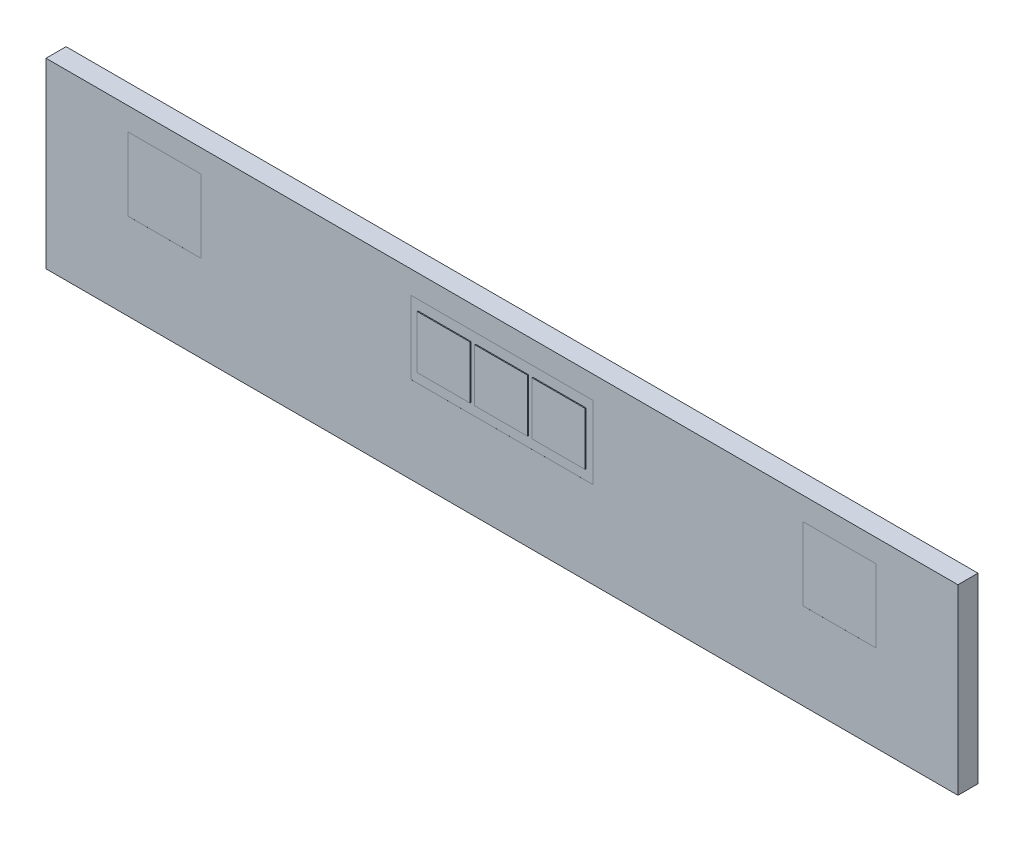
ISO-10303-21;
HEADER;
FILE_DESCRIPTION(('STEP AP214'),'2;1');
FILE_NAME('part.step','',(''),(''),'','','');
FILE_SCHEMA(('AUTOMOTIVE_DESIGN { 1 0 10303 214 1 1 1 1 }'));
ENDSEC;
DATA;
#1=APPLICATION_CONTEXT('core data for automotive mechanical design processes');
#2=APPLICATION_PROTOCOL_DEFINITION('international standard','automotive_design',2000,#1);
#3=PRODUCT_CONTEXT('',#1,'mechanical');
#4=PRODUCT('Part','Part','',(#3));
#5=PRODUCT_RELATED_PRODUCT_CATEGORY('part','',(#4));
#6=PRODUCT_DEFINITION_FORMATION('','',#4);
#7=PRODUCT_DEFINITION_CONTEXT('part definition',#1,'design');
#8=PRODUCT_DEFINITION('design','',#6,#7);
#9=PRODUCT_DEFINITION_SHAPE('','',#8);
#10=(LENGTH_UNIT() NAMED_UNIT(*) SI_UNIT(.MILLI.,.METRE.));
#11=(NAMED_UNIT(*) PLANE_ANGLE_UNIT() SI_UNIT($,.RADIAN.));
#12=(NAMED_UNIT(*) SI_UNIT($,.STERADIAN.) SOLID_ANGLE_UNIT());
#13=UNCERTAINTY_MEASURE_WITH_UNIT(LENGTH_MEASURE(1.E-05),#10,'distance_accuracy_value','');
#14=(GEOMETRIC_REPRESENTATION_CONTEXT(3) GLOBAL_UNCERTAINTY_ASSIGNED_CONTEXT((#13)) GLOBAL_UNIT_ASSIGNED_CONTEXT((#10,
#11,#12)) REPRESENTATION_CONTEXT('',''));
#15=CARTESIAN_POINT('',(0.,0.,0.));
#16=DIRECTION('',(0.,0.,1.));
#17=DIRECTION('',(1.,0.,0.));
#18=AXIS2_PLACEMENT_3D('',#15,#16,#17);
#19=CARTESIAN_POINT('',(-100.01,94.99,21.99));
#20=DIRECTION('',(0.,0.,1.));
#21=DIRECTION('',(1.,0.,0.));
#22=AXIS2_PLACEMENT_3D('',#19,#20,#21);
#23=PLANE('',#22);
#24=DIRECTION('',(1.,0.,0.));
#25=VECTOR('',#24,1.);
#26=CARTESIAN_POINT('',(0.,175.,21.99));
#27=LINE('',#26,#25);
#28=CARTESIAN_POINT('',(-100.,175.,21.99));
#29=VERTEX_POINT('',#28);
#30=CARTESIAN_POINT('',(100.,175.,21.99));
#31=VERTEX_POINT('',#30);
#32=EDGE_CURVE('E399',#29,#31,#27,.T.);
#33=ORIENTED_EDGE('',*,*,#32,.F.);
#34=DIRECTION('',(0.,1.,0.));
#35=VECTOR('',#34,1.);
#36=CARTESIAN_POINT('',(-100.,135.,21.99));
#37=LINE('',#36,#35);
#38=CARTESIAN_POINT('',(-100.,95.,21.99));
#39=VERTEX_POINT('',#38);
#40=EDGE_CURVE('E405',#39,#29,#37,.T.);
#41=ORIENTED_EDGE('',*,*,#40,.F.);
#42=DIRECTION('',(-1.,0.,0.));
#43=VECTOR('',#42,1.);
#44=CARTESIAN_POINT('',(0.,95.,21.99));
#45=LINE('',#44,#43);
#46=CARTESIAN_POINT('',(100.,95.,21.99));
#47=VERTEX_POINT('',#46);
#48=EDGE_CURVE('E410',#47,#39,#45,.T.);
#49=ORIENTED_EDGE('',*,*,#48,.F.);
#50=DIRECTION('',(0.,-1.,0.));
#51=VECTOR('',#50,1.);
#52=CARTESIAN_POINT('',(100.,135.,21.99));
#53=LINE('',#52,#51);
#54=EDGE_CURVE('E415',#31,#47,#53,.T.);
#55=ORIENTED_EDGE('',*,*,#54,.F.);
#56=EDGE_LOOP('',(#33,#41,#49,#55));
#57=FACE_BOUND('',#56,.T.);
#58=DIRECTION('',(1.,0.,0.));
#59=VECTOR('',#58,1.);
#60=CARTESIAN_POINT('',(-92.,106.,21.99));
#61=LINE('',#60,#59);
#62=CARTESIAN_POINT('',(-92.,106.,21.99));
#63=VERTEX_POINT('',#62);
#64=CARTESIAN_POINT('',(-34.,106.,21.99));
#65=VERTEX_POINT('',#64);
#66=EDGE_CURVE('E293',#63,#65,#61,.T.);
#67=ORIENTED_EDGE('',*,*,#66,.F.);
#68=DIRECTION('',(0.,-1.,0.));
#69=VECTOR('',#68,1.);
#70=CARTESIAN_POINT('',(-92.,164.,21.99));
#71=LINE('',#70,#69);
#72=CARTESIAN_POINT('',(-92.,164.,21.99));
#73=VERTEX_POINT('',#72);
#74=EDGE_CURVE('E279',#73,#63,#71,.T.);
#75=ORIENTED_EDGE('',*,*,#74,.F.);
#76=DIRECTION('',(-1.,0.,0.));
#77=VECTOR('',#76,1.);
#78=CARTESIAN_POINT('',(-92.,164.,21.99));
#79=LINE('',#78,#77);
#80=CARTESIAN_POINT('',(-34.,164.,21.99));
#81=VERTEX_POINT('',#80);
#82=EDGE_CURVE('E284',#81,#73,#79,.T.);
#83=ORIENTED_EDGE('',*,*,#82,.F.);
#84=DIRECTION('',(0.,1.,0.));
#85=VECTOR('',#84,1.);
#86=CARTESIAN_POINT('',(-34.,164.,21.99));
#87=LINE('',#86,#85);
#88=EDGE_CURVE('E295',#65,#81,#87,.T.);
#89=ORIENTED_EDGE('',*,*,#88,.F.);
#90=EDGE_LOOP('',(#67,#75,#83,#89));
#91=FACE_BOUND('',#90,.T.);
#92=DIRECTION('',(0.,-1.,0.));
#93=VECTOR('',#92,1.);
#94=CARTESIAN_POINT('',(34.,164.,21.99));
#95=LINE('',#94,#93);
#96=CARTESIAN_POINT('',(34.,164.,21.99));
#97=VERTEX_POINT('',#96);
#98=CARTESIAN_POINT('',(34.,106.,21.99));
#99=VERTEX_POINT('',#98);
#100=EDGE_CURVE('E251',#97,#99,#95,.T.);
#101=ORIENTED_EDGE('',*,*,#100,.F.);
#102=DIRECTION('',(-1.,0.,0.));
#103=VECTOR('',#102,1.);
#104=CARTESIAN_POINT('',(92.,164.,21.99));
#105=LINE('',#104,#103);
#106=CARTESIAN_POINT('',(92.,164.,21.99));
#107=VERTEX_POINT('',#106);
#108=EDGE_CURVE('E248',#107,#97,#105,.T.);
#109=ORIENTED_EDGE('',*,*,#108,.F.);
#110=DIRECTION('',(0.,1.,0.));
#111=VECTOR('',#110,1.);
#112=CARTESIAN_POINT('',(92.,164.,21.99));
#113=LINE('',#112,#111);
#114=CARTESIAN_POINT('',(92.,106.,21.99));
#115=VERTEX_POINT('',#114);
#116=EDGE_CURVE('E260',#115,#107,#113,.T.);
#117=ORIENTED_EDGE('',*,*,#116,.F.);
#118=DIRECTION('',(1.,0.,0.));
#119=VECTOR('',#118,1.);
#120=CARTESIAN_POINT('',(92.,106.,21.99));
#121=LINE('',#120,#119);
#122=EDGE_CURVE('E268',#99,#115,#121,.T.);
#123=ORIENTED_EDGE('',*,*,#122,.F.);
#124=EDGE_LOOP('',(#101,#109,#117,#123));
#125=FACE_BOUND('',#124,.T.);
#126=DIRECTION('',(1.,0.,0.));
#127=VECTOR('',#126,1.);
#128=CARTESIAN_POINT('',(-29.,106.,21.99));
#129=LINE('',#128,#127);
#130=CARTESIAN_POINT('',(-29.,106.,21.99));
#131=VERTEX_POINT('',#130);
#132=CARTESIAN_POINT('',(29.,106.,21.99));
#133=VERTEX_POINT('',#132);
#134=EDGE_CURVE('E694',#131,#133,#129,.T.);
#135=ORIENTED_EDGE('',*,*,#134,.F.);
#136=DIRECTION('',(0.,-1.,0.));
#137=VECTOR('',#136,1.);
#138=CARTESIAN_POINT('',(-29.,164.,21.99));
#139=LINE('',#138,#137);
#140=CARTESIAN_POINT('',(-29.,164.,21.99));
#141=VERTEX_POINT('',#140);
#142=EDGE_CURVE('E246',#141,#131,#139,.T.);
#143=ORIENTED_EDGE('',*,*,#142,.F.);
#144=DIRECTION('',(-1.,0.,0.));
#145=VECTOR('',#144,1.);
#146=CARTESIAN_POINT('',(29.,164.,21.99));
#147=LINE('',#146,#145);
#148=CARTESIAN_POINT('',(29.,164.,21.99));
#149=VERTEX_POINT('',#148);
#150=EDGE_CURVE('E242',#149,#141,#147,.T.);
#151=ORIENTED_EDGE('',*,*,#150,.F.);
#152=DIRECTION('',(0.,1.,0.));
#153=VECTOR('',#152,1.);
#154=CARTESIAN_POINT('',(29.,164.,21.99));
#155=LINE('',#154,#153);
#156=EDGE_CURVE('E691',#133,#149,#155,.T.);
#157=ORIENTED_EDGE('',*,*,#156,.F.);
#158=EDGE_LOOP('',(#135,#143,#151,#157));
#159=FACE_BOUND('',#158,.T.);
#160=ADVANCED_FACE('F35',(#57,#91,#125,#159),#23,.T.);
#161=CARTESIAN_POINT('',(329.99,94.99,21.99));
#162=DIRECTION('',(0.,0.,1.));
#163=DIRECTION('',(1.,0.,0.));
#164=AXIS2_PLACEMENT_3D('',#161,#162,#163);
#165=PLANE('',#164);
#166=DIRECTION('',(1.,0.,0.));
#167=VECTOR('',#166,1.);
#168=CARTESIAN_POINT('',(370.,175.,21.99));
#169=LINE('',#168,#167);
#170=CARTESIAN_POINT('',(330.,175.,21.99));
#171=VERTEX_POINT('',#170);
#172=CARTESIAN_POINT('',(410.,175.,21.99));
#173=VERTEX_POINT('',#172);
#174=EDGE_CURVE('E420',#171,#173,#169,.T.);
#175=ORIENTED_EDGE('',*,*,#174,.F.);
#176=DIRECTION('',(0.,1.,0.));
#177=VECTOR('',#176,1.);
#178=CARTESIAN_POINT('',(330.,135.,21.99));
#179=LINE('',#178,#177);
#180=CARTESIAN_POINT('',(330.,95.0000000000001,21.99));
#181=VERTEX_POINT('',#180);
#182=EDGE_CURVE('E426',#181,#171,#179,.T.);
#183=ORIENTED_EDGE('',*,*,#182,.F.);
#184=DIRECTION('',(-1.,0.,0.));
#185=VECTOR('',#184,1.);
#186=CARTESIAN_POINT('',(370.,95.0000000000001,21.99));
#187=LINE('',#186,#185);
#188=CARTESIAN_POINT('',(410.,95.,21.99));
#189=VERTEX_POINT('',#188);
#190=EDGE_CURVE('E431',#189,#181,#187,.T.);
#191=ORIENTED_EDGE('',*,*,#190,.F.);
#192=DIRECTION('',(0.,-1.,0.));
#193=VECTOR('',#192,1.);
#194=CARTESIAN_POINT('',(410.,135.,21.99));
#195=LINE('',#194,#193);
#196=EDGE_CURVE('E39',#173,#189,#195,.T.);
#197=ORIENTED_EDGE('',*,*,#196,.F.);
#198=EDGE_LOOP('',(#175,#183,#191,#197));
#199=FACE_BOUND('',#198,.T.);
#200=ADVANCED_FACE('F443',(#199),#165,.T.);
#201=CARTESIAN_POINT('',(410.,94.99,22.001));
#202=DIRECTION('',(-1.,0.,0.));
#203=DIRECTION('',(0.,1.,0.));
#204=AXIS2_PLACEMENT_3D('',#201,#202,#203);
#205=PLANE('',#204);
#206=ORIENTED_EDGE('',*,*,#196,.T.);
#207=DIRECTION('',(0.,0.,-1.));
#208=VECTOR('',#207,1.);
#209=CARTESIAN_POINT('',(410.,95.,21.995));
#210=LINE('',#209,#208);
#211=CARTESIAN_POINT('',(410.,95.,22.));
#212=VERTEX_POINT('',#211);
#213=EDGE_CURVE('E432',#212,#189,#210,.T.);
#214=ORIENTED_EDGE('',*,*,#213,.F.);
#215=DIRECTION('',(0.,-1.,0.));
#216=VECTOR('',#215,1.);
#217=CARTESIAN_POINT('',(410.,100.,22.));
#218=LINE('',#217,#216);
#219=CARTESIAN_POINT('',(410.,175.,22.));
#220=VERTEX_POINT('',#219);
#221=EDGE_CURVE('E387',#220,#212,#218,.T.);
#222=ORIENTED_EDGE('',*,*,#221,.F.);
#223=DIRECTION('',(0.,0.,1.));
#224=VECTOR('',#223,1.);
#225=CARTESIAN_POINT('',(410.,175.,21.995));
#226=LINE('',#225,#224);
#227=EDGE_CURVE('E417',#173,#220,#226,.T.);
#228=ORIENTED_EDGE('',*,*,#227,.F.);
#229=EDGE_LOOP('',(#206,#214,#222,#228));
#230=FACE_BOUND('',#229,.T.);
#231=ADVANCED_FACE('F439',(#230),#205,.T.);
#232=CARTESIAN_POINT('',(329.99,95.0000000000001,22.001));
#233=DIRECTION('',(0.,1.,0.));
#234=DIRECTION('',(1.,0.,0.));
#235=AXIS2_PLACEMENT_3D('',#232,#233,#234);
#236=PLANE('',#235);
#237=ORIENTED_EDGE('',*,*,#190,.T.);
#238=DIRECTION('',(0.,0.,-1.));
#239=VECTOR('',#238,1.);
#240=CARTESIAN_POINT('',(330.,95.0000000000001,21.995));
#241=LINE('',#240,#239);
#242=CARTESIAN_POINT('',(330.,95.0000000000001,22.));
#243=VERTEX_POINT('',#242);
#244=EDGE_CURVE('E428',#243,#181,#241,.T.);
#245=ORIENTED_EDGE('',*,*,#244,.F.);
#246=DIRECTION('',(-1.,0.,0.));
#247=VECTOR('',#246,1.);
#248=CARTESIAN_POINT('',(360.,95.,22.));
#249=LINE('',#248,#247);
#250=EDGE_CURVE('E384',#212,#243,#249,.T.);
#251=ORIENTED_EDGE('',*,*,#250,.F.);
#252=ORIENTED_EDGE('',*,*,#213,.T.);
#253=EDGE_LOOP('',(#237,#245,#251,#252));
#254=FACE_BOUND('',#253,.T.);
#255=ADVANCED_FACE('F444',(#254),#236,.T.);
#256=CARTESIAN_POINT('',(330.,175.01,22.001));
#257=DIRECTION('',(1.,0.,0.));
#258=DIRECTION('',(0.,-1.,0.));
#259=AXIS2_PLACEMENT_3D('',#256,#257,#258);
#260=PLANE('',#259);
#261=ORIENTED_EDGE('',*,*,#182,.T.);
#262=DIRECTION('',(0.,0.,-1.));
#263=VECTOR('',#262,1.);
#264=CARTESIAN_POINT('',(330.,175.,21.995));
#265=LINE('',#264,#263);
#266=CARTESIAN_POINT('',(330.,175.,22.));
#267=VERTEX_POINT('',#266);
#268=EDGE_CURVE('E423',#267,#171,#265,.T.);
#269=ORIENTED_EDGE('',*,*,#268,.F.);
#270=DIRECTION('',(0.,1.,0.));
#271=VECTOR('',#270,1.);
#272=CARTESIAN_POINT('',(330.,100.,22.));
#273=LINE('',#272,#271);
#274=EDGE_CURVE('E381',#243,#267,#273,.T.);
#275=ORIENTED_EDGE('',*,*,#274,.F.);
#276=ORIENTED_EDGE('',*,*,#244,.T.);
#277=EDGE_LOOP('',(#261,#269,#275,#276));
#278=FACE_BOUND('',#277,.T.);
#279=ADVANCED_FACE('F447',(#278),#260,.T.);
#280=CARTESIAN_POINT('',(410.01,175.,22.001));
#281=DIRECTION('',(0.,-1.,0.));
#282=DIRECTION('',(-1.,0.,0.));
#283=AXIS2_PLACEMENT_3D('',#280,#281,#282);
#284=PLANE('',#283);
#285=ORIENTED_EDGE('',*,*,#174,.T.);
#286=ORIENTED_EDGE('',*,*,#227,.T.);
#287=DIRECTION('',(1.,0.,0.));
#288=VECTOR('',#287,1.);
#289=CARTESIAN_POINT('',(360.,175.,22.));
#290=LINE('',#289,#288);
#291=EDGE_CURVE('E378',#267,#220,#290,.T.);
#292=ORIENTED_EDGE('',*,*,#291,.F.);
#293=ORIENTED_EDGE('',*,*,#268,.T.);
#294=EDGE_LOOP('',(#285,#286,#292,#293));
#295=FACE_BOUND('',#294,.T.);
#296=ADVANCED_FACE('F452',(#295),#284,.T.);
#297=CARTESIAN_POINT('',(100.,94.99,22.001));
#298=DIRECTION('',(-1.,0.,0.));
#299=DIRECTION('',(0.,1.,0.));
#300=AXIS2_PLACEMENT_3D('',#297,#298,#299);
#301=PLANE('',#300);
#302=ORIENTED_EDGE('',*,*,#54,.T.);
#303=DIRECTION('',(0.,0.,-1.));
#304=VECTOR('',#303,1.);
#305=CARTESIAN_POINT('',(100.,95.,21.995));
#306=LINE('',#305,#304);
#307=CARTESIAN_POINT('',(100.,95.,22.));
#308=VERTEX_POINT('',#307);
#309=EDGE_CURVE('E412',#308,#47,#306,.T.);
#310=ORIENTED_EDGE('',*,*,#309,.F.);
#311=DIRECTION('',(0.,-1.,0.));
#312=VECTOR('',#311,1.);
#313=CARTESIAN_POINT('',(100.,100.,22.));
#314=LINE('',#313,#312);
#315=CARTESIAN_POINT('',(100.,175.,22.));
#316=VERTEX_POINT('',#315);
#317=EDGE_CURVE('E375',#316,#308,#314,.T.);
#318=ORIENTED_EDGE('',*,*,#317,.F.);
#319=DIRECTION('',(0.,0.,1.));
#320=VECTOR('',#319,1.);
#321=CARTESIAN_POINT('',(100.,175.,21.995));
#322=LINE('',#321,#320);
#323=EDGE_CURVE('E396',#31,#316,#322,.T.);
#324=ORIENTED_EDGE('',*,*,#323,.F.);
#325=EDGE_LOOP('',(#302,#310,#318,#324));
#326=FACE_BOUND('',#325,.T.);
#327=ADVANCED_FACE('F454',(#326),#301,.T.);
#328=CARTESIAN_POINT('',(-100.01,95.,22.001));
#329=DIRECTION('',(0.,1.,0.));
#330=DIRECTION('',(1.,0.,0.));
#331=AXIS2_PLACEMENT_3D('',#328,#329,#330);
#332=PLANE('',#331);
#333=ORIENTED_EDGE('',*,*,#48,.T.);
#334=DIRECTION('',(0.,0.,-1.));
#335=VECTOR('',#334,1.);
#336=CARTESIAN_POINT('',(-100.,95.,21.995));
#337=LINE('',#336,#335);
#338=CARTESIAN_POINT('',(-100.,95.,22.));
#339=VERTEX_POINT('',#338);
#340=EDGE_CURVE('E407',#339,#39,#337,.T.);
#341=ORIENTED_EDGE('',*,*,#340,.F.);
#342=DIRECTION('',(-1.,0.,0.));
#343=VECTOR('',#342,1.);
#344=CARTESIAN_POINT('',(0.,95.,22.));
#345=LINE('',#344,#343);
#346=EDGE_CURVE('E372',#308,#339,#345,.T.);
#347=ORIENTED_EDGE('',*,*,#346,.F.);
#348=ORIENTED_EDGE('',*,*,#309,.T.);
#349=EDGE_LOOP('',(#333,#341,#347,#348));
#350=FACE_BOUND('',#349,.T.);
#351=ADVANCED_FACE('F461',(#350),#332,.T.);
#352=CARTESIAN_POINT('',(-100.,175.01,22.001));
#353=DIRECTION('',(1.,0.,0.));
#354=DIRECTION('',(0.,-1.,0.));
#355=AXIS2_PLACEMENT_3D('',#352,#353,#354);
#356=PLANE('',#355);
#357=ORIENTED_EDGE('',*,*,#40,.T.);
#358=DIRECTION('',(0.,0.,-1.));
#359=VECTOR('',#358,1.);
#360=CARTESIAN_POINT('',(-100.,175.,21.995));
#361=LINE('',#360,#359);
#362=CARTESIAN_POINT('',(-100.,175.,22.));
#363=VERTEX_POINT('',#362);
#364=EDGE_CURVE('E402',#363,#29,#361,.T.);
#365=ORIENTED_EDGE('',*,*,#364,.F.);
#366=DIRECTION('',(0.,1.,0.));
#367=VECTOR('',#366,1.);
#368=CARTESIAN_POINT('',(-100.,100.,22.));
#369=LINE('',#368,#367);
#370=EDGE_CURVE('E369',#339,#363,#369,.T.);
#371=ORIENTED_EDGE('',*,*,#370,.F.);
#372=ORIENTED_EDGE('',*,*,#340,.T.);
#373=EDGE_LOOP('',(#357,#365,#371,#372));
#374=FACE_BOUND('',#373,.T.);
#375=ADVANCED_FACE('F785',(#374),#356,.T.);
#376=CARTESIAN_POINT('',(100.01,175.,22.001));
#377=DIRECTION('',(0.,-1.,0.));
#378=DIRECTION('',(-1.,0.,0.));
#379=AXIS2_PLACEMENT_3D('',#376,#377,#378);
#380=PLANE('',#379);
#381=ORIENTED_EDGE('',*,*,#32,.T.);
#382=ORIENTED_EDGE('',*,*,#323,.T.);
#383=DIRECTION('',(1.,0.,0.));
#384=VECTOR('',#383,1.);
#385=CARTESIAN_POINT('',(0.,175.,22.));
#386=LINE('',#385,#384);
#387=EDGE_CURVE('E366',#363,#316,#386,.T.);
#388=ORIENTED_EDGE('',*,*,#387,.F.);
#389=ORIENTED_EDGE('',*,*,#364,.T.);
#390=EDGE_LOOP('',(#381,#382,#388,#389));
#391=FACE_BOUND('',#390,.T.);
#392=ADVANCED_FACE('F777',(#391),#380,.T.);
#393=CARTESIAN_POINT('',(500.01,-0.00999999999999446,0.));
#394=DIRECTION('',(0.,0.,-1.));
#395=DIRECTION('',(-1.,0.,0.));
#396=AXIS2_PLACEMENT_3D('',#393,#394,#395);
#397=PLANE('',#396);
#398=DIRECTION('',(-1.,0.,0.));
#399=VECTOR('',#398,1.);
#400=CARTESIAN_POINT('',(0.,200.,0.));
#401=LINE('',#400,#399);
#402=CARTESIAN_POINT('',(500.,200.,0.));
#403=VERTEX_POINT('',#402);
#404=CARTESIAN_POINT('',(-500.,200.,0.));
#405=VERTEX_POINT('',#404);
#406=EDGE_CURVE('E363',#403,#405,#401,.T.);
#407=ORIENTED_EDGE('',*,*,#406,.F.);
#408=DIRECTION('',(0.,1.,0.));
#409=VECTOR('',#408,1.);
#410=CARTESIAN_POINT('',(500.,100.,0.));
#411=LINE('',#410,#409);
#412=CARTESIAN_POINT('',(500.,0.,0.));
#413=VERTEX_POINT('',#412);
#414=EDGE_CURVE('E393',#413,#403,#411,.T.);
#415=ORIENTED_EDGE('',*,*,#414,.F.);
#416=DIRECTION('',(1.,0.,0.));
#417=VECTOR('',#416,1.);
#418=CARTESIAN_POINT('',(0.,0.,0.));
#419=LINE('',#418,#417);
#420=CARTESIAN_POINT('',(-500.,0.,0.));
#421=VERTEX_POINT('',#420);
#422=EDGE_CURVE('E351',#421,#413,#419,.T.);
#423=ORIENTED_EDGE('',*,*,#422,.F.);
#424=DIRECTION('',(0.,-1.,0.));
#425=VECTOR('',#424,1.);
#426=CARTESIAN_POINT('',(-500.,100.,0.));
#427=LINE('',#426,#425);
#428=EDGE_CURVE('E357',#405,#421,#427,.T.);
#429=ORIENTED_EDGE('',*,*,#428,.F.);
#430=EDGE_LOOP('',(#407,#415,#423,#429));
#431=FACE_BOUND('',#430,.T.);
#432=ADVANCED_FACE('F769',(#431),#397,.T.);
#433=CARTESIAN_POINT('',(500.,-0.01,-0.01));
#434=DIRECTION('',(1.,0.,0.));
#435=DIRECTION('',(0.,1.,0.));
#436=AXIS2_PLACEMENT_3D('',#433,#434,#435);
#437=PLANE('',#436);
#438=DIRECTION('',(0.,1.,0.));
#439=VECTOR('',#438,1.);
#440=CARTESIAN_POINT('',(500.,100.,22.));
#441=LINE('',#440,#439);
#442=CARTESIAN_POINT('',(500.,0.,22.));
#443=VERTEX_POINT('',#442);
#444=CARTESIAN_POINT('',(500.,200.,22.));
#445=VERTEX_POINT('',#444);
#446=EDGE_CURVE('E390',#443,#445,#441,.T.);
#447=ORIENTED_EDGE('',*,*,#446,.F.);
#448=DIRECTION('',(0.,0.,1.));
#449=VECTOR('',#448,1.);
#450=CARTESIAN_POINT('',(500.,0.,11.));
#451=LINE('',#450,#449);
#452=EDGE_CURVE('E348',#413,#443,#451,.T.);
#453=ORIENTED_EDGE('',*,*,#452,.F.);
#454=ORIENTED_EDGE('',*,*,#414,.T.);
#455=DIRECTION('',(0.,0.,-1.));
#456=VECTOR('',#455,1.);
#457=CARTESIAN_POINT('',(500.,200.,11.));
#458=LINE('',#457,#456);
#459=EDGE_CURVE('E360',#445,#403,#458,.T.);
#460=ORIENTED_EDGE('',*,*,#459,.F.);
#461=EDGE_LOOP('',(#447,#453,#454,#460));
#462=FACE_BOUND('',#461,.T.);
#463=ADVANCED_FACE('F761',(#462),#437,.T.);
#464=CARTESIAN_POINT('',(500.01,200.,-0.01));
#465=DIRECTION('',(0.,1.,0.));
#466=DIRECTION('',(-1.,0.,0.));
#467=AXIS2_PLACEMENT_3D('',#464,#465,#466);
#468=PLANE('',#467);
#469=DIRECTION('',(-1.,0.,0.));
#470=VECTOR('',#469,1.);
#471=CARTESIAN_POINT('',(-360.,200.,22.));
#472=LINE('',#471,#470);
#473=CARTESIAN_POINT('',(-500.,200.,22.));
#474=VERTEX_POINT('',#473);
#475=EDGE_CURVE('E333',#445,#474,#472,.T.);
#476=ORIENTED_EDGE('',*,*,#475,.F.);
#477=ORIENTED_EDGE('',*,*,#459,.T.);
#478=ORIENTED_EDGE('',*,*,#406,.T.);
#479=DIRECTION('',(0.,0.,-1.));
#480=VECTOR('',#479,1.);
#481=CARTESIAN_POINT('',(-500.,200.,11.));
#482=LINE('',#481,#480);
#483=EDGE_CURVE('E354',#474,#405,#482,.T.);
#484=ORIENTED_EDGE('',*,*,#483,.F.);
#485=EDGE_LOOP('',(#476,#477,#478,#484));
#486=FACE_BOUND('',#485,.T.);
#487=ADVANCED_FACE('F753',(#486),#468,.T.);
#488=CARTESIAN_POINT('',(-500.,200.01,-0.01));
#489=DIRECTION('',(-1.,0.,0.));
#490=DIRECTION('',(0.,-1.,0.));
#491=AXIS2_PLACEMENT_3D('',#488,#489,#490);
#492=PLANE('',#491);
#493=DIRECTION('',(0.,-1.,0.));
#494=VECTOR('',#493,1.);
#495=CARTESIAN_POINT('',(-500.,100.,22.));
#496=LINE('',#495,#494);
#497=CARTESIAN_POINT('',(-500.,0.,22.));
#498=VERTEX_POINT('',#497);
#499=EDGE_CURVE('E330',#474,#498,#496,.T.);
#500=ORIENTED_EDGE('',*,*,#499,.F.);
#501=ORIENTED_EDGE('',*,*,#483,.T.);
#502=ORIENTED_EDGE('',*,*,#428,.T.);
#503=DIRECTION('',(0.,0.,-1.));
#504=VECTOR('',#503,1.);
#505=CARTESIAN_POINT('',(-500.,0.,11.));
#506=LINE('',#505,#504);
#507=EDGE_CURVE('E345',#498,#421,#506,.T.);
#508=ORIENTED_EDGE('',*,*,#507,.F.);
#509=EDGE_LOOP('',(#500,#501,#502,#508));
#510=FACE_BOUND('',#509,.T.);
#511=ADVANCED_FACE('F746',(#510),#492,.T.);
#512=CARTESIAN_POINT('',(-500.01,0.,-0.01));
#513=DIRECTION('',(0.,-1.,0.));
#514=DIRECTION('',(1.,0.,0.));
#515=AXIS2_PLACEMENT_3D('',#512,#513,#514);
#516=PLANE('',#515);
#517=DIRECTION('',(1.,0.,0.));
#518=VECTOR('',#517,1.);
#519=CARTESIAN_POINT('',(-360.,0.,22.));
#520=LINE('',#519,#518);
#521=EDGE_CURVE('E328',#498,#443,#520,.T.);
#522=ORIENTED_EDGE('',*,*,#521,.F.);
#523=ORIENTED_EDGE('',*,*,#507,.T.);
#524=ORIENTED_EDGE('',*,*,#422,.T.);
#525=ORIENTED_EDGE('',*,*,#452,.T.);
#526=EDGE_LOOP('',(#522,#523,#524,#525));
#527=FACE_BOUND('',#526,.T.);
#528=ADVANCED_FACE('F514',(#527),#516,.T.);
#529=CARTESIAN_POINT('',(-410.01,95.,22.001));
#530=DIRECTION('',(0.,1.,0.));
#531=DIRECTION('',(1.,0.,0.));
#532=AXIS2_PLACEMENT_3D('',#529,#530,#531);
#533=PLANE('',#532);
#534=DIRECTION('',(1.,0.,0.));
#535=VECTOR('',#534,1.);
#536=CARTESIAN_POINT('',(-370.,95.,21.99));
#537=LINE('',#536,#535);
#538=CARTESIAN_POINT('',(-410.,95.,21.99));
#539=VERTEX_POINT('',#538);
#540=CARTESIAN_POINT('',(-330.,95.,21.99));
#541=VERTEX_POINT('',#540);
#542=EDGE_CURVE('E316',#539,#541,#537,.T.);
#543=ORIENTED_EDGE('',*,*,#542,.F.);
#544=DIRECTION('',(0.,0.,-1.));
#545=VECTOR('',#544,1.);
#546=CARTESIAN_POINT('',(-410.,95.,21.995));
#547=LINE('',#546,#545);
#548=CARTESIAN_POINT('',(-410.,95.,22.));
#549=VERTEX_POINT('',#548);
#550=EDGE_CURVE('E338',#549,#539,#547,.T.);
#551=ORIENTED_EDGE('',*,*,#550,.F.);
#552=DIRECTION('',(-1.,0.,0.));
#553=VECTOR('',#552,1.);
#554=CARTESIAN_POINT('',(-360.,95.,22.));
#555=LINE('',#554,#553);
#556=CARTESIAN_POINT('',(-330.,95.,22.));
#557=VERTEX_POINT('',#556);
#558=EDGE_CURVE('E325',#557,#549,#555,.T.);
#559=ORIENTED_EDGE('',*,*,#558,.F.);
#560=DIRECTION('',(0.,0.,-1.));
#561=VECTOR('',#560,1.);
#562=CARTESIAN_POINT('',(-330.,95.,21.995));
#563=LINE('',#562,#561);
#564=EDGE_CURVE('E343',#557,#541,#563,.T.);
#565=ORIENTED_EDGE('',*,*,#564,.T.);
#566=EDGE_LOOP('',(#543,#551,#559,#565));
#567=FACE_BOUND('',#566,.T.);
#568=ADVANCED_FACE('F496',(#567),#533,.T.);
#569=CARTESIAN_POINT('',(-329.99,175.,22.001));
#570=DIRECTION('',(0.,-1.,0.));
#571=DIRECTION('',(-1.,0.,0.));
#572=AXIS2_PLACEMENT_3D('',#569,#570,#571);
#573=PLANE('',#572);
#574=DIRECTION('',(-1.,0.,0.));
#575=VECTOR('',#574,1.);
#576=CARTESIAN_POINT('',(-370.,175.,21.99));
#577=LINE('',#576,#575);
#578=CARTESIAN_POINT('',(-330.,175.,21.99));
#579=VERTEX_POINT('',#578);
#580=CARTESIAN_POINT('',(-410.,175.,21.99));
#581=VERTEX_POINT('',#580);
#582=EDGE_CURVE('E313',#579,#581,#577,.T.);
#583=ORIENTED_EDGE('',*,*,#582,.F.);
#584=DIRECTION('',(0.,0.,1.));
#585=VECTOR('',#584,1.);
#586=CARTESIAN_POINT('',(-330.,175.,21.995));
#587=LINE('',#586,#585);
#588=CARTESIAN_POINT('',(-330.,175.,22.));
#589=VERTEX_POINT('',#588);
#590=EDGE_CURVE('E341',#579,#589,#587,.T.);
#591=ORIENTED_EDGE('',*,*,#590,.T.);
#592=DIRECTION('',(1.,0.,0.));
#593=VECTOR('',#592,1.);
#594=CARTESIAN_POINT('',(-360.,175.,22.));
#595=LINE('',#594,#593);
#596=CARTESIAN_POINT('',(-410.,175.,22.));
#597=VERTEX_POINT('',#596);
#598=EDGE_CURVE('E319',#597,#589,#595,.T.);
#599=ORIENTED_EDGE('',*,*,#598,.F.);
#600=DIRECTION('',(0.,0.,1.));
#601=VECTOR('',#600,1.);
#602=CARTESIAN_POINT('',(-410.,175.,21.995));
#603=LINE('',#602,#601);
#604=EDGE_CURVE('E336',#581,#597,#603,.T.);
#605=ORIENTED_EDGE('',*,*,#604,.F.);
#606=EDGE_LOOP('',(#583,#591,#599,#605));
#607=FACE_BOUND('',#606,.T.);
#608=ADVANCED_FACE('F505',(#607),#573,.T.);
#609=CARTESIAN_POINT('',(-410.,175.01,22.001));
#610=DIRECTION('',(1.,0.,0.));
#611=DIRECTION('',(0.,-1.,0.));
#612=AXIS2_PLACEMENT_3D('',#609,#610,#611);
#613=PLANE('',#612);
#614=DIRECTION('',(0.,-1.,0.));
#615=VECTOR('',#614,1.);
#616=CARTESIAN_POINT('',(-410.,135.,21.99));
#617=LINE('',#616,#615);
#618=EDGE_CURVE('E310',#581,#539,#617,.T.);
#619=ORIENTED_EDGE('',*,*,#618,.F.);
#620=ORIENTED_EDGE('',*,*,#604,.T.);
#621=DIRECTION('',(0.,1.,0.));
#622=VECTOR('',#621,1.);
#623=CARTESIAN_POINT('',(-410.,100.,22.));
#624=LINE('',#623,#622);
#625=EDGE_CURVE('E322',#549,#597,#624,.T.);
#626=ORIENTED_EDGE('',*,*,#625,.F.);
#627=ORIENTED_EDGE('',*,*,#550,.T.);
#628=EDGE_LOOP('',(#619,#620,#626,#627));
#629=FACE_BOUND('',#628,.T.);
#630=ADVANCED_FACE('F499',(#629),#613,.T.);
#631=CARTESIAN_POINT('',(-500.01,-0.00999999999999446,22.));
#632=DIRECTION('',(0.,0.,1.));
#633=DIRECTION('',(1.,0.,0.));
#634=AXIS2_PLACEMENT_3D('',#631,#632,#633);
#635=PLANE('',#634);
#636=ORIENTED_EDGE('',*,*,#625,.T.);
#637=ORIENTED_EDGE('',*,*,#598,.T.);
#638=DIRECTION('',(0.,1.,0.));
#639=VECTOR('',#638,1.);
#640=CARTESIAN_POINT('',(-330.,135.,22.));
#641=LINE('',#640,#639);
#642=EDGE_CURVE('E44',#557,#589,#641,.T.);
#643=ORIENTED_EDGE('',*,*,#642,.F.);
#644=ORIENTED_EDGE('',*,*,#558,.T.);
#645=EDGE_LOOP('',(#636,#637,#643,#644));
#646=FACE_BOUND('',#645,.T.);
#647=ORIENTED_EDGE('',*,*,#499,.T.);
#648=ORIENTED_EDGE('',*,*,#521,.T.);
#649=ORIENTED_EDGE('',*,*,#446,.T.);
#650=ORIENTED_EDGE('',*,*,#475,.T.);
#651=EDGE_LOOP('',(#647,#648,#649,#650));
#652=FACE_BOUND('',#651,.T.);
#653=ORIENTED_EDGE('',*,*,#370,.T.);
#654=ORIENTED_EDGE('',*,*,#387,.T.);
#655=ORIENTED_EDGE('',*,*,#317,.T.);
#656=ORIENTED_EDGE('',*,*,#346,.T.);
#657=EDGE_LOOP('',(#653,#654,#655,#656));
#658=FACE_BOUND('',#657,.T.);
#659=ORIENTED_EDGE('',*,*,#274,.T.);
#660=ORIENTED_EDGE('',*,*,#291,.T.);
#661=ORIENTED_EDGE('',*,*,#221,.T.);
#662=ORIENTED_EDGE('',*,*,#250,.T.);
#663=EDGE_LOOP('',(#659,#660,#661,#662));
#664=FACE_BOUND('',#663,.T.);
#665=ADVANCED_FACE('F450',(#646,#652,#658,#664),#635,.T.);
#666=CARTESIAN_POINT('',(-410.01,94.99,21.99));
#667=DIRECTION('',(0.,0.,1.));
#668=DIRECTION('',(1.,0.,0.));
#669=AXIS2_PLACEMENT_3D('',#666,#667,#668);
#670=PLANE('',#669);
#671=ORIENTED_EDGE('',*,*,#582,.T.);
#672=ORIENTED_EDGE('',*,*,#618,.T.);
#673=ORIENTED_EDGE('',*,*,#542,.T.);
#674=DIRECTION('',(0.,-1.,0.));
#675=VECTOR('',#674,1.);
#676=CARTESIAN_POINT('',(-330.,135.,21.99));
#677=LINE('',#676,#675);
#678=EDGE_CURVE('E11',#579,#541,#677,.T.);
#679=ORIENTED_EDGE('',*,*,#678,.F.);
#680=EDGE_LOOP('',(#671,#672,#673,#679));
#681=FACE_BOUND('',#680,.T.);
#682=ADVANCED_FACE('F478',(#681),#670,.T.);
#683=CARTESIAN_POINT('',(-330.,94.99,22.001));
#684=DIRECTION('',(-1.,0.,0.));
#685=DIRECTION('',(0.,1.,0.));
#686=AXIS2_PLACEMENT_3D('',#683,#684,#685);
#687=PLANE('',#686);
#688=ORIENTED_EDGE('',*,*,#678,.T.);
#689=ORIENTED_EDGE('',*,*,#564,.F.);
#690=ORIENTED_EDGE('',*,*,#642,.T.);
#691=ORIENTED_EDGE('',*,*,#590,.F.);
#692=EDGE_LOOP('',(#688,#689,#690,#691));
#693=FACE_BOUND('',#692,.T.);
#694=ADVANCED_FACE('F37',(#693),#687,.T.);
#695=CARTESIAN_POINT('',(-92.,164.,22.99));
#696=DIRECTION('',(1.,0.,0.));
#697=DIRECTION('',(0.,0.,-1.));
#698=AXIS2_PLACEMENT_3D('',#695,#696,#697);
#699=PLANE('',#698);
#700=ORIENTED_EDGE('',*,*,#74,.T.);
#701=DIRECTION('',(0.,0.,-1.));
#702=VECTOR('',#701,1.);
#703=CARTESIAN_POINT('',(-92.,106.,22.99));
#704=LINE('',#703,#702);
#705=CARTESIAN_POINT('',(-92.,106.,22.99));
#706=VERTEX_POINT('',#705);
#707=EDGE_CURVE('E306',#706,#63,#704,.T.);
#708=ORIENTED_EDGE('',*,*,#707,.F.);
#709=DIRECTION('',(0.,-1.,0.));
#710=VECTOR('',#709,1.);
#711=CARTESIAN_POINT('',(-92.,164.,22.99));
#712=LINE('',#711,#710);
#713=CARTESIAN_POINT('',(-92.,164.,22.99));
#714=VERTEX_POINT('',#713);
#715=EDGE_CURVE('E280',#714,#706,#712,.T.);
#716=ORIENTED_EDGE('',*,*,#715,.F.);
#717=DIRECTION('',(0.,0.,-1.));
#718=VECTOR('',#717,1.);
#719=CARTESIAN_POINT('',(-92.,164.,22.99));
#720=LINE('',#719,#718);
#721=EDGE_CURVE('E290',#714,#73,#720,.T.);
#722=ORIENTED_EDGE('',*,*,#721,.T.);
#723=EDGE_LOOP('',(#700,#708,#716,#722));
#724=FACE_BOUND('',#723,.T.);
#725=ADVANCED_FACE('F473',(#724),#699,.F.);
#726=CARTESIAN_POINT('',(-92.,106.,22.99));
#727=DIRECTION('',(0.,1.,0.));
#728=DIRECTION('',(0.,0.,1.));
#729=AXIS2_PLACEMENT_3D('',#726,#727,#728);
#730=PLANE('',#729);
#731=ORIENTED_EDGE('',*,*,#66,.T.);
#732=DIRECTION('',(0.,0.,-1.));
#733=VECTOR('',#732,1.);
#734=CARTESIAN_POINT('',(-34.,106.,22.99));
#735=LINE('',#734,#733);
#736=CARTESIAN_POINT('',(-34.,106.,22.99));
#737=VERTEX_POINT('',#736);
#738=EDGE_CURVE('E303',#737,#65,#735,.T.);
#739=ORIENTED_EDGE('',*,*,#738,.F.);
#740=DIRECTION('',(1.,0.,0.));
#741=VECTOR('',#740,1.);
#742=CARTESIAN_POINT('',(-92.,106.,22.99));
#743=LINE('',#742,#741);
#744=EDGE_CURVE('E283',#706,#737,#743,.T.);
#745=ORIENTED_EDGE('',*,*,#744,.F.);
#746=ORIENTED_EDGE('',*,*,#707,.T.);
#747=EDGE_LOOP('',(#731,#739,#745,#746));
#748=FACE_BOUND('',#747,.T.);
#749=ADVANCED_FACE('F486',(#748),#730,.F.);
#750=CARTESIAN_POINT('',(-34.,164.,22.99));
#751=DIRECTION('',(-1.,0.,0.));
#752=DIRECTION('',(0.,0.,1.));
#753=AXIS2_PLACEMENT_3D('',#750,#751,#752);
#754=PLANE('',#753);
#755=ORIENTED_EDGE('',*,*,#88,.T.);
#756=DIRECTION('',(0.,0.,-1.));
#757=VECTOR('',#756,1.);
#758=CARTESIAN_POINT('',(-34.,164.,22.99));
#759=LINE('',#758,#757);
#760=CARTESIAN_POINT('',(-34.,164.,22.99));
#761=VERTEX_POINT('',#760);
#762=EDGE_CURVE('E301',#761,#81,#759,.T.);
#763=ORIENTED_EDGE('',*,*,#762,.F.);
#764=DIRECTION('',(0.,1.,0.));
#765=VECTOR('',#764,1.);
#766=CARTESIAN_POINT('',(-34.,164.,22.99));
#767=LINE('',#766,#765);
#768=EDGE_CURVE('E286',#737,#761,#767,.T.);
#769=ORIENTED_EDGE('',*,*,#768,.F.);
#770=ORIENTED_EDGE('',*,*,#738,.T.);
#771=EDGE_LOOP('',(#755,#763,#769,#770));
#772=FACE_BOUND('',#771,.T.);
#773=ADVANCED_FACE('F556',(#772),#754,.F.);
#774=CARTESIAN_POINT('',(-92.,164.,22.99));
#775=DIRECTION('',(0.,-1.,0.));
#776=DIRECTION('',(0.,0.,-1.));
#777=AXIS2_PLACEMENT_3D('',#774,#775,#776);
#778=PLANE('',#777);
#779=ORIENTED_EDGE('',*,*,#82,.T.);
#780=ORIENTED_EDGE('',*,*,#721,.F.);
#781=DIRECTION('',(-1.,0.,0.));
#782=VECTOR('',#781,1.);
#783=CARTESIAN_POINT('',(-92.,164.,22.99));
#784=LINE('',#783,#782);
#785=EDGE_CURVE('E288',#761,#714,#784,.T.);
#786=ORIENTED_EDGE('',*,*,#785,.F.);
#787=ORIENTED_EDGE('',*,*,#762,.T.);
#788=EDGE_LOOP('',(#779,#780,#786,#787));
#789=FACE_BOUND('',#788,.T.);
#790=ADVANCED_FACE('F565',(#789),#778,.F.);
#791=CARTESIAN_POINT('',(0.,0.,22.99));
#792=DIRECTION('',(0.,0.,1.));
#793=DIRECTION('',(1.,0.,0.));
#794=AXIS2_PLACEMENT_3D('',#791,#792,#793);
#795=PLANE('',#794);
#796=ORIENTED_EDGE('',*,*,#715,.T.);
#797=ORIENTED_EDGE('',*,*,#744,.T.);
#798=ORIENTED_EDGE('',*,*,#768,.T.);
#799=ORIENTED_EDGE('',*,*,#785,.T.);
#800=EDGE_LOOP('',(#796,#797,#798,#799));
#801=FACE_BOUND('',#800,.T.);
#802=ADVANCED_FACE('F574',(#801),#795,.T.);
#803=CARTESIAN_POINT('',(92.,164.,22.99));
#804=DIRECTION('',(0.,-1.,0.));
#805=DIRECTION('',(0.,0.,-1.));
#806=AXIS2_PLACEMENT_3D('',#803,#804,#805);
#807=PLANE('',#806);
#808=ORIENTED_EDGE('',*,*,#108,.T.);
#809=DIRECTION('',(0.,0.,-1.));
#810=VECTOR('',#809,1.);
#811=CARTESIAN_POINT('',(34.,164.,22.99));
#812=LINE('',#811,#810);
#813=CARTESIAN_POINT('',(34.,164.,22.99));
#814=VERTEX_POINT('',#813);
#815=EDGE_CURVE('E277',#814,#97,#812,.T.);
#816=ORIENTED_EDGE('',*,*,#815,.F.);
#817=DIRECTION('',(-1.,0.,0.));
#818=VECTOR('',#817,1.);
#819=CARTESIAN_POINT('',(92.,164.,22.99));
#820=LINE('',#819,#818);
#821=CARTESIAN_POINT('',(92.,164.,22.99));
#822=VERTEX_POINT('',#821);
#823=EDGE_CURVE('E256',#822,#814,#820,.T.);
#824=ORIENTED_EDGE('',*,*,#823,.F.);
#825=DIRECTION('',(0.,0.,-1.));
#826=VECTOR('',#825,1.);
#827=CARTESIAN_POINT('',(92.,164.,22.99));
#828=LINE('',#827,#826);
#829=EDGE_CURVE('E265',#822,#107,#828,.T.);
#830=ORIENTED_EDGE('',*,*,#829,.T.);
#831=EDGE_LOOP('',(#808,#816,#824,#830));
#832=FACE_BOUND('',#831,.T.);
#833=ADVANCED_FACE('F583',(#832),#807,.F.);
#834=CARTESIAN_POINT('',(34.,164.,22.99));
#835=DIRECTION('',(1.,0.,0.));
#836=DIRECTION('',(0.,0.,-1.));
#837=AXIS2_PLACEMENT_3D('',#834,#835,#836);
#838=PLANE('',#837);
#839=ORIENTED_EDGE('',*,*,#100,.T.);
#840=DIRECTION('',(0.,0.,-1.));
#841=VECTOR('',#840,1.);
#842=CARTESIAN_POINT('',(34.,106.,22.99));
#843=LINE('',#842,#841);
#844=CARTESIAN_POINT('',(34.,106.,22.99));
#845=VERTEX_POINT('',#844);
#846=EDGE_CURVE('E274',#845,#99,#843,.T.);
#847=ORIENTED_EDGE('',*,*,#846,.F.);
#848=DIRECTION('',(0.,-1.,0.));
#849=VECTOR('',#848,1.);
#850=CARTESIAN_POINT('',(34.,164.,22.99));
#851=LINE('',#850,#849);
#852=EDGE_CURVE('E259',#814,#845,#851,.T.);
#853=ORIENTED_EDGE('',*,*,#852,.F.);
#854=ORIENTED_EDGE('',*,*,#815,.T.);
#855=EDGE_LOOP('',(#839,#847,#853,#854));
#856=FACE_BOUND('',#855,.T.);
#857=ADVANCED_FACE('F592',(#856),#838,.F.);
#858=CARTESIAN_POINT('',(92.,106.,22.99));
#859=DIRECTION('',(0.,1.,0.));
#860=DIRECTION('',(0.,0.,1.));
#861=AXIS2_PLACEMENT_3D('',#858,#859,#860);
#862=PLANE('',#861);
#863=ORIENTED_EDGE('',*,*,#122,.T.);
#864=DIRECTION('',(0.,0.,-1.));
#865=VECTOR('',#864,1.);
#866=CARTESIAN_POINT('',(92.,106.,22.99));
#867=LINE('',#866,#865);
#868=CARTESIAN_POINT('',(92.,106.,22.99));
#869=VERTEX_POINT('',#868);
#870=EDGE_CURVE('E60',#869,#115,#867,.T.);
#871=ORIENTED_EDGE('',*,*,#870,.F.);
#872=DIRECTION('',(1.,0.,0.));
#873=VECTOR('',#872,1.);
#874=CARTESIAN_POINT('',(92.,106.,22.99));
#875=LINE('',#874,#873);
#876=EDGE_CURVE('E262',#845,#869,#875,.T.);
#877=ORIENTED_EDGE('',*,*,#876,.F.);
#878=ORIENTED_EDGE('',*,*,#846,.T.);
#879=EDGE_LOOP('',(#863,#871,#877,#878));
#880=FACE_BOUND('',#879,.T.);
#881=ADVANCED_FACE('F601',(#880),#862,.F.);
#882=CARTESIAN_POINT('',(92.,164.,22.99));
#883=DIRECTION('',(-1.,0.,0.));
#884=DIRECTION('',(0.,0.,1.));
#885=AXIS2_PLACEMENT_3D('',#882,#883,#884);
#886=PLANE('',#885);
#887=ORIENTED_EDGE('',*,*,#116,.T.);
#888=ORIENTED_EDGE('',*,*,#829,.F.);
#889=DIRECTION('',(0.,1.,0.));
#890=VECTOR('',#889,1.);
#891=CARTESIAN_POINT('',(92.,164.,22.99));
#892=LINE('',#891,#890);
#893=EDGE_CURVE('E264',#869,#822,#892,.T.);
#894=ORIENTED_EDGE('',*,*,#893,.F.);
#895=ORIENTED_EDGE('',*,*,#870,.T.);
#896=EDGE_LOOP('',(#887,#888,#894,#895));
#897=FACE_BOUND('',#896,.T.);
#898=ADVANCED_FACE('F610',(#897),#886,.F.);
#899=CARTESIAN_POINT('',(0.,0.,22.99));
#900=DIRECTION('',(0.,0.,1.));
#901=DIRECTION('',(1.,0.,0.));
#902=AXIS2_PLACEMENT_3D('',#899,#900,#901);
#903=PLANE('',#902);
#904=ORIENTED_EDGE('',*,*,#823,.T.);
#905=ORIENTED_EDGE('',*,*,#852,.T.);
#906=ORIENTED_EDGE('',*,*,#876,.T.);
#907=ORIENTED_EDGE('',*,*,#893,.T.);
#908=EDGE_LOOP('',(#904,#905,#906,#907));
#909=FACE_BOUND('',#908,.T.);
#910=ADVANCED_FACE('F619',(#909),#903,.T.);
#911=CARTESIAN_POINT('',(-29.,164.,22.99));
#912=DIRECTION('',(1.,0.,0.));
#913=DIRECTION('',(0.,1.,0.));
#914=AXIS2_PLACEMENT_3D('',#911,#912,#913);
#915=PLANE('',#914);
#916=ORIENTED_EDGE('',*,*,#142,.T.);
#917=DIRECTION('',(0.,0.,-1.));
#918=VECTOR('',#917,1.);
#919=CARTESIAN_POINT('',(-29.,106.,22.99));
#920=LINE('',#919,#918);
#921=CARTESIAN_POINT('',(-29.,106.,22.99));
#922=VERTEX_POINT('',#921);
#923=EDGE_CURVE('E227',#922,#131,#920,.T.);
#924=ORIENTED_EDGE('',*,*,#923,.F.);
#925=DIRECTION('',(0.,-1.,0.));
#926=VECTOR('',#925,1.);
#927=CARTESIAN_POINT('',(-29.,164.,22.99));
#928=LINE('',#927,#926);
#929=CARTESIAN_POINT('',(-29.,164.,22.99));
#930=VERTEX_POINT('',#929);
#931=EDGE_CURVE('E234',#930,#922,#928,.T.);
#932=ORIENTED_EDGE('',*,*,#931,.F.);
#933=DIRECTION('',(0.,0.,-1.));
#934=VECTOR('',#933,1.);
#935=CARTESIAN_POINT('',(-29.,164.,22.99));
#936=LINE('',#935,#934);
#937=EDGE_CURVE('E688',#930,#141,#936,.T.);
#938=ORIENTED_EDGE('',*,*,#937,.T.);
#939=EDGE_LOOP('',(#916,#924,#932,#938));
#940=FACE_BOUND('',#939,.T.);
#941=ADVANCED_FACE('F244',(#940),#915,.F.);
#942=CARTESIAN_POINT('',(-29.,106.,22.99));
#943=DIRECTION('',(0.,1.,0.));
#944=DIRECTION('',(0.,0.,1.));
#945=AXIS2_PLACEMENT_3D('',#942,#943,#944);
#946=PLANE('',#945);
#947=ORIENTED_EDGE('',*,*,#134,.T.);
#948=DIRECTION('',(0.,0.,-1.));
#949=VECTOR('',#948,1.);
#950=CARTESIAN_POINT('',(29.,106.,22.99));
#951=LINE('',#950,#949);
#952=CARTESIAN_POINT('',(29.,106.,22.99));
#953=VERTEX_POINT('',#952);
#954=EDGE_CURVE('E230',#953,#133,#951,.T.);
#955=ORIENTED_EDGE('',*,*,#954,.F.);
#956=DIRECTION('',(1.,0.,0.));
#957=VECTOR('',#956,1.);
#958=CARTESIAN_POINT('',(-29.,106.,22.99));
#959=LINE('',#958,#957);
#960=EDGE_CURVE('E223',#922,#953,#959,.T.);
#961=ORIENTED_EDGE('',*,*,#960,.F.);
#962=ORIENTED_EDGE('',*,*,#923,.T.);
#963=EDGE_LOOP('',(#947,#955,#961,#962));
#964=FACE_BOUND('',#963,.T.);
#965=ADVANCED_FACE('F225',(#964),#946,.F.);
#966=CARTESIAN_POINT('',(29.,164.,22.99));
#967=DIRECTION('',(-1.,0.,0.));
#968=DIRECTION('',(0.,-1.,0.));
#969=AXIS2_PLACEMENT_3D('',#966,#967,#968);
#970=PLANE('',#969);
#971=ORIENTED_EDGE('',*,*,#156,.T.);
#972=DIRECTION('',(0.,0.,-1.));
#973=VECTOR('',#972,1.);
#974=CARTESIAN_POINT('',(29.,164.,22.99));
#975=LINE('',#974,#973);
#976=CARTESIAN_POINT('',(29.,164.,22.99));
#977=VERTEX_POINT('',#976);
#978=EDGE_CURVE('E52',#977,#149,#975,.T.);
#979=ORIENTED_EDGE('',*,*,#978,.F.);
#980=DIRECTION('',(0.,1.,0.));
#981=VECTOR('',#980,1.);
#982=CARTESIAN_POINT('',(29.,164.,22.99));
#983=LINE('',#982,#981);
#984=EDGE_CURVE('E233',#953,#977,#983,.T.);
#985=ORIENTED_EDGE('',*,*,#984,.F.);
#986=ORIENTED_EDGE('',*,*,#954,.T.);
#987=EDGE_LOOP('',(#971,#979,#985,#986));
#988=FACE_BOUND('',#987,.T.);
#989=ADVANCED_FACE('F643',(#988),#970,.F.);
#990=CARTESIAN_POINT('',(29.,164.,22.99));
#991=DIRECTION('',(0.,-1.,0.));
#992=DIRECTION('',(0.,0.,-1.));
#993=AXIS2_PLACEMENT_3D('',#990,#991,#992);
#994=PLANE('',#993);
#995=ORIENTED_EDGE('',*,*,#150,.T.);
#996=ORIENTED_EDGE('',*,*,#937,.F.);
#997=DIRECTION('',(-1.,0.,0.));
#998=VECTOR('',#997,1.);
#999=CARTESIAN_POINT('',(29.,164.,22.99));
#1000=LINE('',#999,#998);
#1001=EDGE_CURVE('E238',#977,#930,#1000,.T.);
#1002=ORIENTED_EDGE('',*,*,#1001,.F.);
#1003=ORIENTED_EDGE('',*,*,#978,.T.);
#1004=EDGE_LOOP('',(#995,#996,#1002,#1003));
#1005=FACE_BOUND('',#1004,.T.);
#1006=ADVANCED_FACE('F651',(#1005),#994,.F.);
#1007=CARTESIAN_POINT('',(0.,0.,22.99));
#1008=DIRECTION('',(0.,0.,1.));
#1009=DIRECTION('',(1.,0.,0.));
#1010=AXIS2_PLACEMENT_3D('',#1007,#1008,#1009);
#1011=PLANE('',#1010);
#1012=ORIENTED_EDGE('',*,*,#931,.T.);
#1013=ORIENTED_EDGE('',*,*,#960,.T.);
#1014=ORIENTED_EDGE('',*,*,#984,.T.);
#1015=ORIENTED_EDGE('',*,*,#1001,.T.);
#1016=EDGE_LOOP('',(#1012,#1013,#1014,#1015));
#1017=FACE_BOUND('',#1016,.T.);
#1018=ADVANCED_FACE('F237',(#1017),#1011,.T.);
#1019=CLOSED_SHELL('',(#160,#200,#231,#255,#279,#296,#327,#351,#375,#392,#432,#463,#487,#511,
#528,#568,#608,#630,#665,#682,#694,#725,#749,#773,#790,#802,#833,#857,#881,#898,#910,#941,#965,
#989,#1006,#1018));
#1020=MANIFOLD_SOLID_BREP('B2',#1019);
#1021=ADVANCED_BREP_SHAPE_REPRESENTATION('',(#18,#1020),#14);
#1022=SHAPE_DEFINITION_REPRESENTATION(#9,#1021);
ENDSEC;
END-ISO-10303-21;
